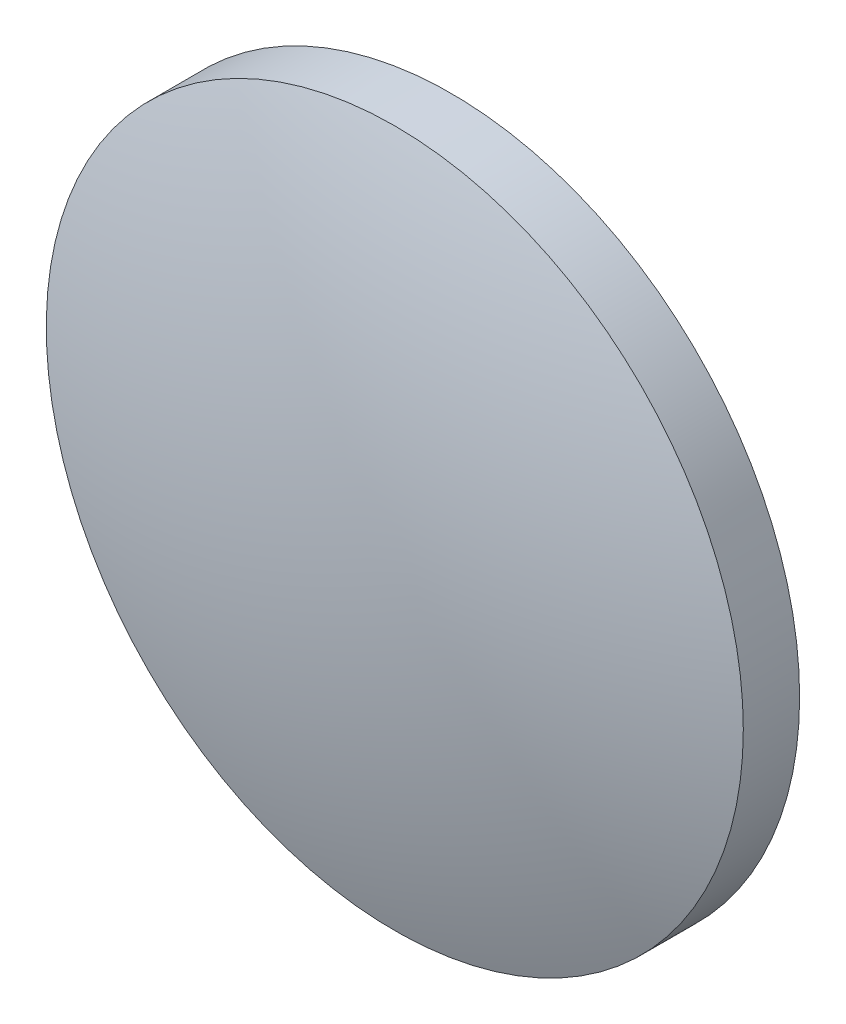
ISO-10303-21;
HEADER;
FILE_DESCRIPTION(('STEP AP214'),'2;1');
FILE_NAME('part.step','',(''),(''),'','','');
FILE_SCHEMA(('AUTOMOTIVE_DESIGN { 1 0 10303 214 1 1 1 1 }'));
ENDSEC;
DATA;
#1=APPLICATION_CONTEXT('core data for automotive mechanical design processes');
#2=APPLICATION_PROTOCOL_DEFINITION('international standard','automotive_design',2000,#1);
#3=PRODUCT_CONTEXT('',#1,'mechanical');
#4=PRODUCT('Part','Part','',(#3));
#5=PRODUCT_RELATED_PRODUCT_CATEGORY('part','',(#4));
#6=PRODUCT_DEFINITION_FORMATION('','',#4);
#7=PRODUCT_DEFINITION_CONTEXT('part definition',#1,'design');
#8=PRODUCT_DEFINITION('design','',#6,#7);
#9=PRODUCT_DEFINITION_SHAPE('','',#8);
#10=(LENGTH_UNIT() NAMED_UNIT(*) SI_UNIT(.MILLI.,.METRE.));
#11=(NAMED_UNIT(*) PLANE_ANGLE_UNIT() SI_UNIT($,.RADIAN.));
#12=(NAMED_UNIT(*) SI_UNIT($,.STERADIAN.) SOLID_ANGLE_UNIT());
#13=UNCERTAINTY_MEASURE_WITH_UNIT(LENGTH_MEASURE(1.E-05),#10,'distance_accuracy_value','');
#14=(GEOMETRIC_REPRESENTATION_CONTEXT(3) GLOBAL_UNCERTAINTY_ASSIGNED_CONTEXT((#13)) GLOBAL_UNIT_ASSIGNED_CONTEXT((#10,
#11,#12)) REPRESENTATION_CONTEXT('',''));
#15=CARTESIAN_POINT('',(0.,0.,0.));
#16=DIRECTION('',(0.,0.,1.));
#17=DIRECTION('',(1.,0.,0.));
#18=AXIS2_PLACEMENT_3D('',#15,#16,#17);
#19=CARTESIAN_POINT('',(0.,0.,-36.55));
#20=DIRECTION('',(0.,0.,1.));
#21=DIRECTION('',(0.,1.,0.));
#22=AXIS2_PLACEMENT_3D('',#19,#20,#21);
#23=SPHERICAL_SURFACE('',#22,38.6);
#24=CARTESIAN_POINT('',(0.,0.,-0.0300054764516677));
#25=DIRECTION('',(0.,0.,1.));
#26=DIRECTION('',(1.,0.,0.));
#27=AXIS2_PLACEMENT_3D('',#24,#25,#26);
#28=CIRCLE('',#27,12.5);
#29=CARTESIAN_POINT('',(12.5,0.,-0.0300054764516677));
#30=VERTEX_POINT('',#29);
#31=EDGE_CURVE('E8',#30,#30,#28,.T.);
#32=ORIENTED_EDGE('',*,*,#31,.T.);
#33=EDGE_LOOP('',(#32));
#34=FACE_BOUND('',#33,.T.);
#35=ADVANCED_FACE('F12',(#34),#23,.T.);
#36=CARTESIAN_POINT('',(0.,0.,4.30813204540037));
#37=DIRECTION('',(0.,0.,1.));
#38=DIRECTION('',(1.,0.,0.));
#39=AXIS2_PLACEMENT_3D('',#36,#37,#38);
#40=CYLINDRICAL_SURFACE('',#39,12.5);
#41=ORIENTED_EDGE('',*,*,#31,.F.);
#42=EDGE_LOOP('',(#41));
#43=FACE_BOUND('',#42,.T.);
#44=CARTESIAN_POINT('',(0.,0.,-2.05));
#45=DIRECTION('',(0.,0.,1.));
#46=DIRECTION('',(1.,0.,0.));
#47=AXIS2_PLACEMENT_3D('',#44,#45,#46);
#48=CIRCLE('',#47,12.5);
#49=CARTESIAN_POINT('',(12.5,0.,-2.05));
#50=VERTEX_POINT('',#49);
#51=EDGE_CURVE('E18',#50,#50,#48,.T.);
#52=ORIENTED_EDGE('',*,*,#51,.T.);
#53=EDGE_LOOP('',(#52));
#54=FACE_BOUND('',#53,.T.);
#55=ADVANCED_FACE('F24',(#43,#54),#40,.T.);
#56=CARTESIAN_POINT('',(0.,0.,-2.05));
#57=DIRECTION('',(0.,0.,1.));
#58=DIRECTION('',(1.,0.,0.));
#59=AXIS2_PLACEMENT_3D('',#56,#57,#58);
#60=PLANE('',#59);
#61=ORIENTED_EDGE('',*,*,#51,.F.);
#62=EDGE_LOOP('',(#61));
#63=FACE_BOUND('',#62,.T.);
#64=ADVANCED_FACE('F26',(#63),#60,.F.);
#65=CLOSED_SHELL('',(#35,#55,#64));
#66=MANIFOLD_SOLID_BREP('B1',#65);
#67=ADVANCED_BREP_SHAPE_REPRESENTATION('',(#18,#66),#14);
#68=SHAPE_DEFINITION_REPRESENTATION(#9,#67);
ENDSEC;
END-ISO-10303-21;
